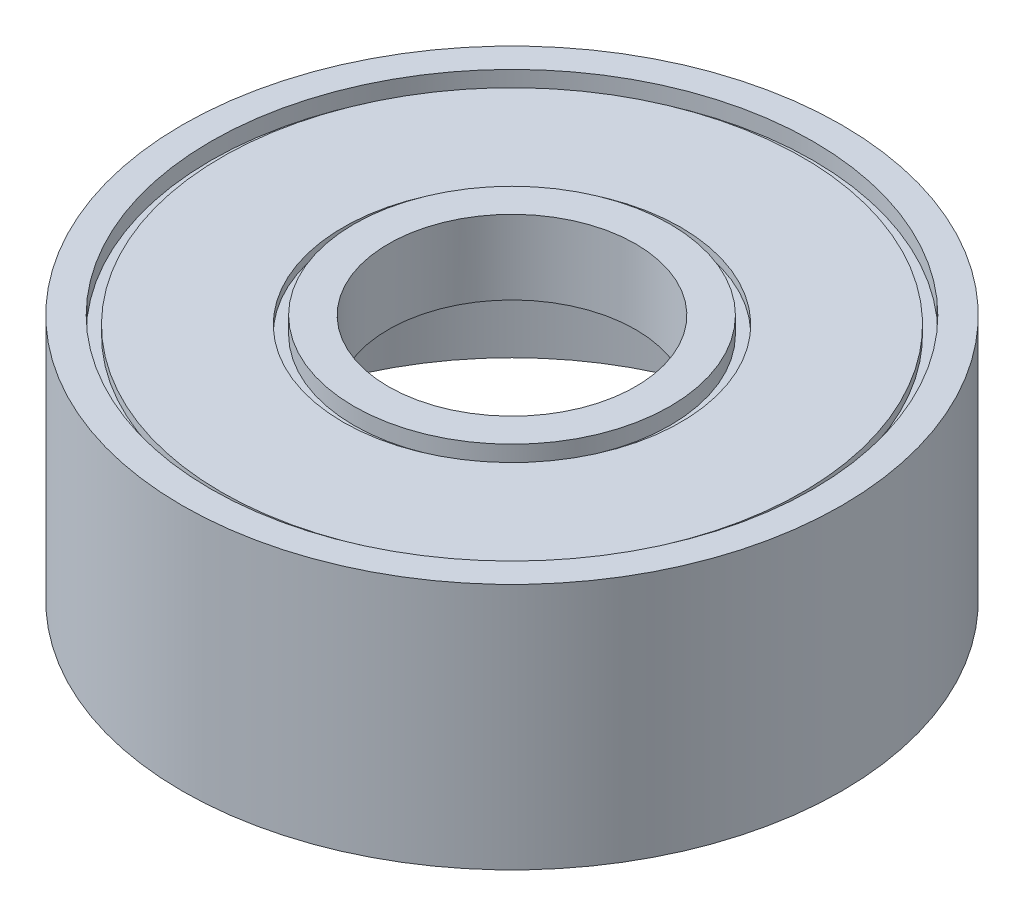
ISO-10303-21;
HEADER;
FILE_DESCRIPTION(('STEP AP214'),'2;1');
FILE_NAME('part.step','',(''),(''),'','','');
FILE_SCHEMA(('AUTOMOTIVE_DESIGN { 1 0 10303 214 1 1 1 1 }'));
ENDSEC;
DATA;
#1=APPLICATION_CONTEXT('core data for automotive mechanical design processes');
#2=APPLICATION_PROTOCOL_DEFINITION('international standard','automotive_design',2000,#1);
#3=PRODUCT_CONTEXT('',#1,'mechanical');
#4=PRODUCT('Part','Part','',(#3));
#5=PRODUCT_RELATED_PRODUCT_CATEGORY('part','',(#4));
#6=PRODUCT_DEFINITION_FORMATION('','',#4);
#7=PRODUCT_DEFINITION_CONTEXT('part definition',#1,'design');
#8=PRODUCT_DEFINITION('design','',#6,#7);
#9=PRODUCT_DEFINITION_SHAPE('','',#8);
#10=(LENGTH_UNIT() NAMED_UNIT(*) SI_UNIT(.MILLI.,.METRE.));
#11=(NAMED_UNIT(*) PLANE_ANGLE_UNIT() SI_UNIT($,.RADIAN.));
#12=(NAMED_UNIT(*) SI_UNIT($,.STERADIAN.) SOLID_ANGLE_UNIT());
#13=UNCERTAINTY_MEASURE_WITH_UNIT(LENGTH_MEASURE(1.E-05),#10,'distance_accuracy_value','');
#14=(GEOMETRIC_REPRESENTATION_CONTEXT(3) GLOBAL_UNCERTAINTY_ASSIGNED_CONTEXT((#13)) GLOBAL_UNIT_ASSIGNED_CONTEXT((#10,
#11,#12)) REPRESENTATION_CONTEXT('',''));
#15=CARTESIAN_POINT('',(0.,0.,0.));
#16=DIRECTION('',(0.,0.,1.));
#17=DIRECTION('',(1.,0.,0.));
#18=AXIS2_PLACEMENT_3D('',#15,#16,#17);
#19=CARTESIAN_POINT('',(0.,3.,0.));
#20=DIRECTION('',(0.,-1.,0.));
#21=DIRECTION('',(0.,0.,-1.));
#22=AXIS2_PLACEMENT_3D('',#19,#20,#21);
#23=CYLINDRICAL_SURFACE('',#22,1.5);
#24=CARTESIAN_POINT('',(0.,3.,0.));
#25=DIRECTION('',(0.,1.,0.));
#26=DIRECTION('',(0.,0.,1.));
#27=AXIS2_PLACEMENT_3D('',#24,#25,#26);
#28=CIRCLE('',#27,1.5);
#29=CARTESIAN_POINT('',(0.,3.,1.5));
#30=VERTEX_POINT('',#29);
#31=EDGE_CURVE('E46',#30,#30,#28,.T.);
#32=ORIENTED_EDGE('',*,*,#31,.T.);
#33=EDGE_LOOP('',(#32));
#34=FACE_BOUND('',#33,.T.);
#35=CARTESIAN_POINT('',(0.,2.1,0.));
#36=DIRECTION('',(0.,-1.,0.));
#37=DIRECTION('',(0.,0.,-1.));
#38=AXIS2_PLACEMENT_3D('',#35,#36,#37);
#39=CIRCLE('',#38,1.5);
#40=CARTESIAN_POINT('',(0.,2.1,-1.5));
#41=VERTEX_POINT('',#40);
#42=EDGE_CURVE('E37',#41,#41,#39,.T.);
#43=ORIENTED_EDGE('',*,*,#42,.T.);
#44=EDGE_LOOP('',(#43));
#45=FACE_BOUND('',#44,.T.);
#46=ADVANCED_FACE('F33',(#34,#45),#23,.F.);
#47=CARTESIAN_POINT('',(0.,2.9,0.));
#48=DIRECTION('',(0.,1.,0.));
#49=DIRECTION('',(0.,0.,1.));
#50=AXIS2_PLACEMENT_3D('',#47,#48,#49);
#51=PLANE('',#50);
#52=CARTESIAN_POINT('',(0.,2.9,0.));
#53=DIRECTION('',(0.,1.,0.));
#54=DIRECTION('',(0.,0.,1.));
#55=AXIS2_PLACEMENT_3D('',#52,#53,#54);
#56=CIRCLE('',#55,2.04811409770207);
#57=CARTESIAN_POINT('',(0.,2.9,2.04811409770207));
#58=VERTEX_POINT('',#57);
#59=EDGE_CURVE('E57',#58,#58,#56,.T.);
#60=ORIENTED_EDGE('',*,*,#59,.F.);
#61=EDGE_LOOP('',(#60));
#62=FACE_BOUND('',#61,.T.);
#63=CARTESIAN_POINT('',(0.,2.9,0.));
#64=DIRECTION('',(0.,1.,0.));
#65=DIRECTION('',(0.,0.,1.));
#66=AXIS2_PLACEMENT_3D('',#63,#64,#65);
#67=CIRCLE('',#66,3.52211411783974);
#68=CARTESIAN_POINT('',(0.,2.9,3.52211411783974));
#69=VERTEX_POINT('',#68);
#70=EDGE_CURVE('E69',#69,#69,#67,.T.);
#71=ORIENTED_EDGE('',*,*,#70,.T.);
#72=EDGE_LOOP('',(#71));
#73=FACE_BOUND('',#72,.T.);
#74=ADVANCED_FACE('F96',(#62,#73),#51,.T.);
#75=CARTESIAN_POINT('',(0.,3.,0.));
#76=DIRECTION('',(0.,1.,0.));
#77=DIRECTION('',(0.,0.,1.));
#78=AXIS2_PLACEMENT_3D('',#75,#76,#77);
#79=PLANE('',#78);
#80=ORIENTED_EDGE('',*,*,#31,.F.);
#81=EDGE_LOOP('',(#80));
#82=FACE_BOUND('',#81,.T.);
#83=CARTESIAN_POINT('',(0.,3.,0.));
#84=DIRECTION('',(0.,1.,0.));
#85=DIRECTION('',(0.,0.,1.));
#86=AXIS2_PLACEMENT_3D('',#83,#84,#85);
#87=CIRCLE('',#86,1.9167447400123);
#88=CARTESIAN_POINT('',(0.,3.,1.9167447400123));
#89=VERTEX_POINT('',#88);
#90=EDGE_CURVE('E53',#89,#89,#87,.T.);
#91=ORIENTED_EDGE('',*,*,#90,.T.);
#92=EDGE_LOOP('',(#91));
#93=FACE_BOUND('',#92,.T.);
#94=ADVANCED_FACE('F102',(#82,#93),#79,.T.);
#95=CARTESIAN_POINT('',(0.,3.,0.));
#96=DIRECTION('',(0.,1.,0.));
#97=DIRECTION('',(0.,0.,1.));
#98=AXIS2_PLACEMENT_3D('',#95,#96,#97);
#99=CIRCLE('',#98,3.65315620414847);
#100=CARTESIAN_POINT('',(0.,3.,3.65315620414847));
#101=VERTEX_POINT('',#100);
#102=EDGE_CURVE('E50',#101,#101,#99,.T.);
#103=ORIENTED_EDGE('',*,*,#102,.F.);
#104=EDGE_LOOP('',(#103));
#105=FACE_BOUND('',#104,.T.);
#106=CARTESIAN_POINT('',(0.,3.,0.));
#107=DIRECTION('',(0.,1.,0.));
#108=DIRECTION('',(0.,0.,1.));
#109=AXIS2_PLACEMENT_3D('',#106,#107,#108);
#110=CIRCLE('',#109,4.);
#111=CARTESIAN_POINT('',(0.,3.,4.));
#112=VERTEX_POINT('',#111);
#113=EDGE_CURVE('E10',#112,#112,#110,.T.);
#114=ORIENTED_EDGE('',*,*,#113,.T.);
#115=EDGE_LOOP('',(#114));
#116=FACE_BOUND('',#115,.T.);
#117=ADVANCED_FACE('F108',(#105,#116),#79,.T.);
#118=CARTESIAN_POINT('',(0.,0.,0.));
#119=DIRECTION('',(0.,1.,0.));
#120=DIRECTION('',(0.,0.,1.));
#121=AXIS2_PLACEMENT_3D('',#118,#119,#120);
#122=PLANE('',#121);
#123=CARTESIAN_POINT('',(0.,0.,0.));
#124=DIRECTION('',(0.,-1.,0.));
#125=DIRECTION('',(0.,0.,-1.));
#126=AXIS2_PLACEMENT_3D('',#123,#124,#125);
#127=CIRCLE('',#126,3.61122795143593);
#128=CARTESIAN_POINT('',(0.,0.,-3.61122795143593));
#129=VERTEX_POINT('',#128);
#130=EDGE_CURVE('E74',#129,#129,#127,.T.);
#131=ORIENTED_EDGE('',*,*,#130,.F.);
#132=EDGE_LOOP('',(#131));
#133=FACE_BOUND('',#132,.T.);
#134=CARTESIAN_POINT('',(0.,0.,0.));
#135=DIRECTION('',(0.,1.,0.));
#136=DIRECTION('',(0.,0.,1.));
#137=AXIS2_PLACEMENT_3D('',#134,#135,#136);
#138=CIRCLE('',#137,4.);
#139=CARTESIAN_POINT('',(0.,0.,4.));
#140=VERTEX_POINT('',#139);
#141=EDGE_CURVE('E41',#140,#140,#138,.T.);
#142=ORIENTED_EDGE('',*,*,#141,.F.);
#143=EDGE_LOOP('',(#142));
#144=FACE_BOUND('',#143,.T.);
#145=ADVANCED_FACE('F110',(#133,#144),#122,.F.);
#146=CARTESIAN_POINT('',(0.,3.,0.));
#147=DIRECTION('',(0.,-1.,0.));
#148=DIRECTION('',(0.,0.,-1.));
#149=AXIS2_PLACEMENT_3D('',#146,#147,#148);
#150=CYLINDRICAL_SURFACE('',#149,4.);
#151=ORIENTED_EDGE('',*,*,#113,.F.);
#152=EDGE_LOOP('',(#151));
#153=FACE_BOUND('',#152,.T.);
#154=ORIENTED_EDGE('',*,*,#141,.T.);
#155=EDGE_LOOP('',(#154));
#156=FACE_BOUND('',#155,.T.);
#157=ADVANCED_FACE('F35',(#153,#156),#150,.T.);
#158=CARTESIAN_POINT('',(0.,2.9,0.));
#159=DIRECTION('',(0.,1.,0.));
#160=DIRECTION('',(0.,0.,1.));
#161=AXIS2_PLACEMENT_3D('',#158,#159,#160);
#162=CYLINDRICAL_SURFACE('',#161,3.65315620414847);
#163=ORIENTED_EDGE('',*,*,#102,.T.);
#164=EDGE_LOOP('',(#163));
#165=FACE_BOUND('',#164,.T.);
#166=CARTESIAN_POINT('',(0.,2.8,0.));
#167=DIRECTION('',(0.,1.,0.));
#168=DIRECTION('',(0.,0.,1.));
#169=AXIS2_PLACEMENT_3D('',#166,#167,#168);
#170=CIRCLE('',#169,3.65315620414847);
#171=CARTESIAN_POINT('',(0.,2.8,3.65315620414847));
#172=VERTEX_POINT('',#171);
#173=EDGE_CURVE('E65',#172,#172,#170,.T.);
#174=ORIENTED_EDGE('',*,*,#173,.F.);
#175=EDGE_LOOP('',(#174));
#176=FACE_BOUND('',#175,.T.);
#177=ADVANCED_FACE('F107',(#165,#176),#162,.F.);
#178=CARTESIAN_POINT('',(0.,2.9,0.));
#179=DIRECTION('',(0.,1.,0.));
#180=DIRECTION('',(0.,0.,1.));
#181=AXIS2_PLACEMENT_3D('',#178,#179,#180);
#182=CYLINDRICAL_SURFACE('',#181,1.9167447400123);
#183=ORIENTED_EDGE('',*,*,#90,.F.);
#184=EDGE_LOOP('',(#183));
#185=FACE_BOUND('',#184,.T.);
#186=CARTESIAN_POINT('',(0.,2.8,0.));
#187=DIRECTION('',(0.,1.,0.));
#188=DIRECTION('',(0.,0.,1.));
#189=AXIS2_PLACEMENT_3D('',#186,#187,#188);
#190=CIRCLE('',#189,1.91674474001231);
#191=CARTESIAN_POINT('',(0.,2.8,1.91674474001231));
#192=VERTEX_POINT('',#191);
#193=EDGE_CURVE('E60',#192,#192,#190,.T.);
#194=ORIENTED_EDGE('',*,*,#193,.T.);
#195=EDGE_LOOP('',(#194));
#196=FACE_BOUND('',#195,.T.);
#197=ADVANCED_FACE('F126',(#185,#196),#182,.T.);
#198=CARTESIAN_POINT('',(0.,2.8,0.));
#199=DIRECTION('',(0.,1.,0.));
#200=DIRECTION('',(0.,0.,1.));
#201=AXIS2_PLACEMENT_3D('',#198,#199,#200);
#202=CYLINDRICAL_SURFACE('',#201,2.04811409770207);
#203=CARTESIAN_POINT('',(0.,2.8,0.));
#204=DIRECTION('',(0.,1.,0.));
#205=DIRECTION('',(0.,0.,1.));
#206=AXIS2_PLACEMENT_3D('',#203,#204,#205);
#207=CIRCLE('',#206,2.04811409770207);
#208=CARTESIAN_POINT('',(0.,2.8,2.04811409770207));
#209=VERTEX_POINT('',#208);
#210=EDGE_CURVE('E56',#209,#209,#207,.T.);
#211=ORIENTED_EDGE('',*,*,#210,.F.);
#212=EDGE_LOOP('',(#211));
#213=FACE_BOUND('',#212,.T.);
#214=ORIENTED_EDGE('',*,*,#59,.T.);
#215=EDGE_LOOP('',(#214));
#216=FACE_BOUND('',#215,.T.);
#217=ADVANCED_FACE('F131',(#213,#216),#202,.F.);
#218=CARTESIAN_POINT('',(0.,2.8,0.));
#219=DIRECTION('',(0.,1.,0.));
#220=DIRECTION('',(0.,0.,1.));
#221=AXIS2_PLACEMENT_3D('',#218,#219,#220);
#222=PLANE('',#221);
#223=ORIENTED_EDGE('',*,*,#193,.F.);
#224=EDGE_LOOP('',(#223));
#225=FACE_BOUND('',#224,.T.);
#226=ORIENTED_EDGE('',*,*,#210,.T.);
#227=EDGE_LOOP('',(#226));
#228=FACE_BOUND('',#227,.T.);
#229=ADVANCED_FACE('F140',(#225,#228),#222,.T.);
#230=CARTESIAN_POINT('',(0.,2.8,0.));
#231=DIRECTION('',(0.,1.,0.));
#232=DIRECTION('',(0.,0.,1.));
#233=AXIS2_PLACEMENT_3D('',#230,#231,#232);
#234=PLANE('',#233);
#235=CARTESIAN_POINT('',(0.,2.8,0.));
#236=DIRECTION('',(0.,1.,0.));
#237=DIRECTION('',(0.,0.,1.));
#238=AXIS2_PLACEMENT_3D('',#235,#236,#237);
#239=CIRCLE('',#238,3.52211411783974);
#240=CARTESIAN_POINT('',(0.,2.8,3.52211411783974));
#241=VERTEX_POINT('',#240);
#242=EDGE_CURVE('E68',#241,#241,#239,.T.);
#243=ORIENTED_EDGE('',*,*,#242,.F.);
#244=EDGE_LOOP('',(#243));
#245=FACE_BOUND('',#244,.T.);
#246=ORIENTED_EDGE('',*,*,#173,.T.);
#247=EDGE_LOOP('',(#246));
#248=FACE_BOUND('',#247,.T.);
#249=ADVANCED_FACE('F138',(#245,#248),#234,.T.);
#250=CARTESIAN_POINT('',(0.,2.8,0.));
#251=DIRECTION('',(0.,1.,0.));
#252=DIRECTION('',(0.,0.,1.));
#253=AXIS2_PLACEMENT_3D('',#250,#251,#252);
#254=CYLINDRICAL_SURFACE('',#253,3.52211411783974);
#255=ORIENTED_EDGE('',*,*,#242,.T.);
#256=EDGE_LOOP('',(#255));
#257=FACE_BOUND('',#256,.T.);
#258=ORIENTED_EDGE('',*,*,#70,.F.);
#259=EDGE_LOOP('',(#258));
#260=FACE_BOUND('',#259,.T.);
#261=ADVANCED_FACE('F92',(#257,#260),#254,.T.);
#262=CARTESIAN_POINT('',(0.,2.1,0.));
#263=DIRECTION('',(0.,-1.,0.));
#264=DIRECTION('',(0.,0.,-1.));
#265=AXIS2_PLACEMENT_3D('',#262,#263,#264);
#266=CYLINDRICAL_SURFACE('',#265,3.61122795143593);
#267=CARTESIAN_POINT('',(0.,2.1,0.));
#268=DIRECTION('',(0.,-1.,0.));
#269=DIRECTION('',(0.,0.,-1.));
#270=AXIS2_PLACEMENT_3D('',#267,#268,#269);
#271=CIRCLE('',#270,3.61122795143593);
#272=CARTESIAN_POINT('',(0.,2.1,-3.61122795143593));
#273=VERTEX_POINT('',#272);
#274=EDGE_CURVE('E77',#273,#273,#271,.T.);
#275=ORIENTED_EDGE('',*,*,#274,.F.);
#276=EDGE_LOOP('',(#275));
#277=FACE_BOUND('',#276,.T.);
#278=ORIENTED_EDGE('',*,*,#130,.T.);
#279=EDGE_LOOP('',(#278));
#280=FACE_BOUND('',#279,.T.);
#281=ADVANCED_FACE('F87',(#277,#280),#266,.F.);
#282=CARTESIAN_POINT('',(0.,2.1,0.));
#283=DIRECTION('',(0.,-1.,0.));
#284=DIRECTION('',(0.,0.,-1.));
#285=AXIS2_PLACEMENT_3D('',#282,#283,#284);
#286=PLANE('',#285);
#287=ORIENTED_EDGE('',*,*,#42,.F.);
#288=EDGE_LOOP('',(#287));
#289=FACE_BOUND('',#288,.T.);
#290=ORIENTED_EDGE('',*,*,#274,.T.);
#291=EDGE_LOOP('',(#290));
#292=FACE_BOUND('',#291,.T.);
#293=ADVANCED_FACE('F85',(#289,#292),#286,.T.);
#294=CLOSED_SHELL('',(#46,#74,#94,#117,#145,#157,#177,#197,#217,#229,#249,#261,#281,#293));
#295=MANIFOLD_SOLID_BREP('B2',#294);
#296=ADVANCED_BREP_SHAPE_REPRESENTATION('',(#18,#295),#14);
#297=SHAPE_DEFINITION_REPRESENTATION(#9,#296);
ENDSEC;
END-ISO-10303-21;
